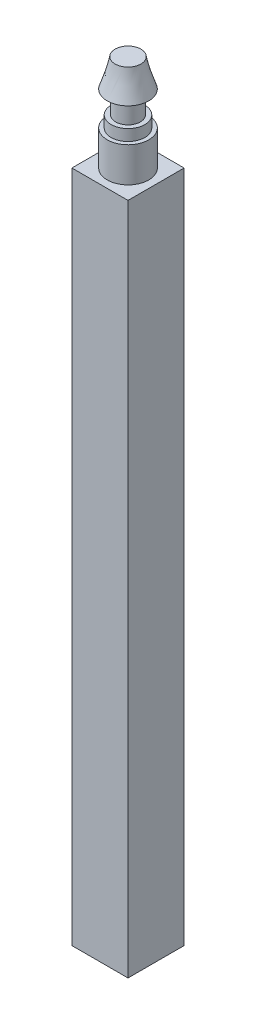
ISO-10303-21;
HEADER;
FILE_DESCRIPTION(('STEP AP214'),'2;1');
FILE_NAME('part.step','',(''),(''),'','','');
FILE_SCHEMA(('AUTOMOTIVE_DESIGN { 1 0 10303 214 1 1 1 1 }'));
ENDSEC;
DATA;
#1=APPLICATION_CONTEXT('core data for automotive mechanical design processes');
#2=APPLICATION_PROTOCOL_DEFINITION('international standard','automotive_design',2000,#1);
#3=PRODUCT_CONTEXT('',#1,'mechanical');
#4=PRODUCT('Part','Part','',(#3));
#5=PRODUCT_RELATED_PRODUCT_CATEGORY('part','',(#4));
#6=PRODUCT_DEFINITION_FORMATION('','',#4);
#7=PRODUCT_DEFINITION_CONTEXT('part definition',#1,'design');
#8=PRODUCT_DEFINITION('design','',#6,#7);
#9=PRODUCT_DEFINITION_SHAPE('','',#8);
#10=(LENGTH_UNIT() NAMED_UNIT(*) SI_UNIT(.MILLI.,.METRE.));
#11=(NAMED_UNIT(*) PLANE_ANGLE_UNIT() SI_UNIT($,.RADIAN.));
#12=(NAMED_UNIT(*) SI_UNIT($,.STERADIAN.) SOLID_ANGLE_UNIT());
#13=UNCERTAINTY_MEASURE_WITH_UNIT(LENGTH_MEASURE(1.E-05),#10,'distance_accuracy_value','');
#14=(GEOMETRIC_REPRESENTATION_CONTEXT(3) GLOBAL_UNCERTAINTY_ASSIGNED_CONTEXT((#13)) GLOBAL_UNIT_ASSIGNED_CONTEXT((#10,
#11,#12)) REPRESENTATION_CONTEXT('',''));
#15=CARTESIAN_POINT('',(0.,0.,0.));
#16=DIRECTION('',(0.,0.,1.));
#17=DIRECTION('',(1.,0.,0.));
#18=AXIS2_PLACEMENT_3D('',#15,#16,#17);
#19=CARTESIAN_POINT('',(0.,3.1,0.));
#20=DIRECTION('',(0.,-1.,0.));
#21=DIRECTION('',(0.,0.,-1.));
#22=AXIS2_PLACEMENT_3D('',#19,#20,#21);
#23=CYLINDRICAL_SURFACE('',#22,1.85);
#24=CARTESIAN_POINT('',(0.,3.1,0.));
#25=DIRECTION('',(0.,1.,0.));
#26=DIRECTION('',(0.,0.,1.));
#27=AXIS2_PLACEMENT_3D('',#24,#25,#26);
#28=CIRCLE('',#27,1.85);
#29=CARTESIAN_POINT('',(0.,3.1,-1.85));
#30=VERTEX_POINT('',#29);
#31=EDGE_CURVE('E175',#30,#30,#28,.T.);
#32=CARTESIAN_POINT('',(0.,0.,0.));
#33=DIRECTION('',(0.,1.,0.));
#34=DIRECTION('',(0.,0.,1.));
#35=AXIS2_PLACEMENT_3D('',#32,#33,#34);
#36=CIRCLE('',#35,1.85);
#37=CARTESIAN_POINT('',(0.,0.,-1.85));
#38=VERTEX_POINT('',#37);
#39=EDGE_CURVE('E42',#38,#38,#36,.T.);
#40=CARTESIAN_POINT('',(0.,3.1,-1.85));
#41=CARTESIAN_POINT('',(0.,3.06770833333333,-1.85));
#42=CARTESIAN_POINT('',(0.,3.03541666666667,-1.85));
#43=CARTESIAN_POINT('',(0.,2.97083333333333,-1.85));
#44=CARTESIAN_POINT('',(0.,2.93854166666667,-1.85));
#45=CARTESIAN_POINT('',(0.,2.87395833333333,-1.85));
#46=CARTESIAN_POINT('',(0.,2.84166666666667,-1.85));
#47=CARTESIAN_POINT('',(0.,2.77708333333333,-1.85));
#48=CARTESIAN_POINT('',(0.,2.74479166666667,-1.85));
#49=CARTESIAN_POINT('',(0.,2.68020833333333,-1.85));
#50=CARTESIAN_POINT('',(0.,2.64791666666667,-1.85));
#51=CARTESIAN_POINT('',(0.,2.58333333333333,-1.85));
#52=CARTESIAN_POINT('',(0.,2.55104166666667,-1.85));
#53=CARTESIAN_POINT('',(0.,2.48645833333333,-1.85));
#54=CARTESIAN_POINT('',(0.,2.45416666666667,-1.85));
#55=CARTESIAN_POINT('',(0.,2.38958333333333,-1.85));
#56=CARTESIAN_POINT('',(0.,2.35729166666667,-1.85));
#57=CARTESIAN_POINT('',(0.,2.29270833333333,-1.85));
#58=CARTESIAN_POINT('',(0.,2.26041666666667,-1.85));
#59=CARTESIAN_POINT('',(0.,2.19583333333333,-1.85));
#60=CARTESIAN_POINT('',(0.,2.16354166666667,-1.85));
#61=CARTESIAN_POINT('',(0.,2.09895833333333,-1.85));
#62=CARTESIAN_POINT('',(0.,2.06666666666667,-1.85));
#63=CARTESIAN_POINT('',(0.,2.00208333333333,-1.85));
#64=CARTESIAN_POINT('',(0.,1.96979166666667,-1.85));
#65=CARTESIAN_POINT('',(0.,1.90520833333333,-1.85));
#66=CARTESIAN_POINT('',(0.,1.87291666666667,-1.85));
#67=CARTESIAN_POINT('',(0.,1.80833333333333,-1.85));
#68=CARTESIAN_POINT('',(0.,1.77604166666667,-1.85));
#69=CARTESIAN_POINT('',(0.,1.71145833333333,-1.85));
#70=CARTESIAN_POINT('',(0.,1.67916666666667,-1.85));
#71=CARTESIAN_POINT('',(0.,1.61458333333333,-1.85));
#72=CARTESIAN_POINT('',(0.,1.58229166666667,-1.85));
#73=CARTESIAN_POINT('',(0.,1.51770833333333,-1.85));
#74=CARTESIAN_POINT('',(0.,1.48541666666667,-1.85));
#75=CARTESIAN_POINT('',(0.,1.42083333333333,-1.85));
#76=CARTESIAN_POINT('',(0.,1.38854166666667,-1.85));
#77=CARTESIAN_POINT('',(0.,1.32395833333333,-1.85));
#78=CARTESIAN_POINT('',(0.,1.29166666666667,-1.85));
#79=CARTESIAN_POINT('',(0.,1.22708333333333,-1.85));
#80=CARTESIAN_POINT('',(0.,1.19479166666667,-1.85));
#81=CARTESIAN_POINT('',(0.,1.13020833333333,-1.85));
#82=CARTESIAN_POINT('',(0.,1.09791666666667,-1.85));
#83=CARTESIAN_POINT('',(0.,1.03333333333333,-1.85));
#84=CARTESIAN_POINT('',(0.,1.00104166666667,-1.85));
#85=CARTESIAN_POINT('',(0.,0.936458333333333,-1.85));
#86=CARTESIAN_POINT('',(0.,0.904166666666667,-1.85));
#87=CARTESIAN_POINT('',(0.,0.839583333333333,-1.85));
#88=CARTESIAN_POINT('',(0.,0.807291666666667,-1.85));
#89=CARTESIAN_POINT('',(0.,0.742708333333333,-1.85));
#90=CARTESIAN_POINT('',(0.,0.710416666666667,-1.85));
#91=CARTESIAN_POINT('',(0.,0.645833333333333,-1.85));
#92=CARTESIAN_POINT('',(0.,0.613541666666667,-1.85));
#93=CARTESIAN_POINT('',(0.,0.548958333333333,-1.85));
#94=CARTESIAN_POINT('',(0.,0.516666666666667,-1.85));
#95=CARTESIAN_POINT('',(0.,0.452083333333333,-1.85));
#96=CARTESIAN_POINT('',(0.,0.419791666666667,-1.85));
#97=CARTESIAN_POINT('',(0.,0.355208333333333,-1.85));
#98=CARTESIAN_POINT('',(0.,0.322916666666667,-1.85));
#99=CARTESIAN_POINT('',(0.,0.258333333333333,-1.85));
#100=CARTESIAN_POINT('',(0.,0.226041666666667,-1.85));
#101=CARTESIAN_POINT('',(0.,0.161458333333333,-1.85));
#102=CARTESIAN_POINT('',(0.,0.129166666666667,-1.85));
#103=CARTESIAN_POINT('',(0.,0.0645833333333335,-1.85));
#104=CARTESIAN_POINT('',(0.,0.0322916666666667,-1.85));
#105=CARTESIAN_POINT('',(0.,0.,-1.85));
#106=B_SPLINE_CURVE_WITH_KNOTS('',3,(#40,#41,#42,#43,#44,#45,#46,#47,#48,#49,#50,#51,#52,#53,
#54,#55,#56,#57,#58,#59,#60,#61,#62,#63,#64,#65,#66,#67,#68,#69,#70,#71,#72,#73,#74,#75,#76,#77,
#78,#79,#80,#81,#82,#83,#84,#85,#86,#87,#88,#89,#90,#91,#92,#93,#94,#95,#96,#97,#98,#99,#100,
#101,#102,#103,#104,#105),.UNSPECIFIED.,.F.,.F.,(4,2,2,2,2,2,2,2,2,2,2,2,2,2,2,2,2,2,2,2,2,2,2,
2,2,2,2,2,2,2,2,2,4),(0.,0.0968749999999997,0.19375,0.290625,0.3875,0.484375,0.58125,0.678125,
0.775,0.871874999999999,0.96875,1.065625,1.1625,1.259375,1.35625,1.453125,1.55,1.646875,1.74375,
1.840625,1.9375,2.034375,2.13125,2.228125,2.325,2.421875,2.51875,2.615625,2.7125,2.809375,
2.90625,3.003125,3.1),.UNSPECIFIED.);
#107=EDGE_CURVE('BSEAM39',#30,#38,#106,.T.);
#108=ORIENTED_EDGE('',*,*,#31,.F.);
#109=ORIENTED_EDGE('',*,*,#39,.T.);
#110=ORIENTED_EDGE('',*,*,#107,.T.);
#111=ORIENTED_EDGE('',*,*,#107,.F.);
#112=EDGE_LOOP('',(#108,#110,#109,#111));
#113=FACE_BOUND('',#112,.T.);
#114=ADVANCED_FACE('F39',(#113),#23,.T.);
#115=CARTESIAN_POINT('',(0.,3.1,0.));
#116=DIRECTION('',(0.,1.,0.));
#117=DIRECTION('',(0.,0.,1.));
#118=AXIS2_PLACEMENT_3D('',#115,#116,#117);
#119=PLANE('',#118);
#120=CARTESIAN_POINT('',(0.,3.1,0.));
#121=DIRECTION('',(0.,1.,0.));
#122=DIRECTION('',(0.,0.,1.));
#123=AXIS2_PLACEMENT_3D('',#120,#121,#122);
#124=CIRCLE('',#123,1.5);
#125=CARTESIAN_POINT('',(0.,3.1,1.5));
#126=VERTEX_POINT('',#125);
#127=EDGE_CURVE('E48',#126,#126,#124,.T.);
#128=ORIENTED_EDGE('',*,*,#127,.F.);
#129=EDGE_LOOP('',(#128));
#130=FACE_BOUND('',#129,.T.);
#131=ORIENTED_EDGE('',*,*,#31,.T.);
#132=EDGE_LOOP('',(#131));
#133=FACE_BOUND('',#132,.T.);
#134=ADVANCED_FACE('F180',(#130,#133),#119,.T.);
#135=CARTESIAN_POINT('',(0.,4.1,0.));
#136=DIRECTION('',(0.,-1.,0.));
#137=DIRECTION('',(0.,0.,-1.));
#138=AXIS2_PLACEMENT_3D('',#135,#136,#137);
#139=CYLINDRICAL_SURFACE('',#138,1.5);
#140=CARTESIAN_POINT('',(0.,4.1,0.));
#141=DIRECTION('',(0.,1.,0.));
#142=DIRECTION('',(0.,0.,1.));
#143=AXIS2_PLACEMENT_3D('',#140,#141,#142);
#144=CIRCLE('',#143,1.5);
#145=CARTESIAN_POINT('',(0.,4.1,1.5));
#146=VERTEX_POINT('',#145);
#147=EDGE_CURVE('E171',#146,#146,#144,.T.);
#148=ORIENTED_EDGE('',*,*,#147,.F.);
#149=EDGE_LOOP('',(#148));
#150=FACE_BOUND('',#149,.T.);
#151=ORIENTED_EDGE('',*,*,#127,.T.);
#152=EDGE_LOOP('',(#151));
#153=FACE_BOUND('',#152,.T.);
#154=ADVANCED_FACE('F203',(#150,#153),#139,.T.);
#155=CARTESIAN_POINT('',(0.,4.1,0.));
#156=DIRECTION('',(0.,1.,0.));
#157=DIRECTION('',(0.,0.,1.));
#158=AXIS2_PLACEMENT_3D('',#155,#156,#157);
#159=PLANE('',#158);
#160=CARTESIAN_POINT('',(0.,4.1,0.));
#161=DIRECTION('',(0.,1.,0.));
#162=DIRECTION('',(0.,0.,1.));
#163=AXIS2_PLACEMENT_3D('',#160,#161,#162);
#164=CIRCLE('',#163,1.1);
#165=CARTESIAN_POINT('',(0.,4.1,1.1));
#166=VERTEX_POINT('',#165);
#167=EDGE_CURVE('E12',#166,#166,#164,.T.);
#168=ORIENTED_EDGE('',*,*,#167,.F.);
#169=EDGE_LOOP('',(#168));
#170=FACE_BOUND('',#169,.T.);
#171=ORIENTED_EDGE('',*,*,#147,.T.);
#172=EDGE_LOOP('',(#171));
#173=FACE_BOUND('',#172,.T.);
#174=ADVANCED_FACE('F198',(#170,#173),#159,.T.);
#175=CARTESIAN_POINT('',(0.,6.1,0.));
#176=DIRECTION('',(0.,-1.,0.));
#177=DIRECTION('',(0.,0.,-1.));
#178=AXIS2_PLACEMENT_3D('',#175,#176,#177);
#179=CYLINDRICAL_SURFACE('',#178,1.1);
#180=CARTESIAN_POINT('',(0.,6.1,0.));
#181=DIRECTION('',(0.,1.,0.));
#182=DIRECTION('',(0.,0.,1.));
#183=AXIS2_PLACEMENT_3D('',#180,#181,#182);
#184=CIRCLE('',#183,1.1);
#185=CARTESIAN_POINT('',(0.,6.1,1.1));
#186=VERTEX_POINT('',#185);
#187=EDGE_CURVE('E167',#186,#186,#184,.T.);
#188=ORIENTED_EDGE('',*,*,#187,.F.);
#189=EDGE_LOOP('',(#188));
#190=FACE_BOUND('',#189,.T.);
#191=ORIENTED_EDGE('',*,*,#167,.T.);
#192=EDGE_LOOP('',(#191));
#193=FACE_BOUND('',#192,.T.);
#194=ADVANCED_FACE('F154',(#190,#193),#179,.T.);
#195=CARTESIAN_POINT('',(0.,8.6,0.));
#196=DIRECTION('',(0.,1.,0.));
#197=DIRECTION('',(0.,0.,1.));
#198=AXIS2_PLACEMENT_3D('',#195,#196,#197);
#199=PLANE('',#198);
#200=CARTESIAN_POINT('',(0.,8.6,0.));
#201=DIRECTION('',(0.,1.,0.));
#202=DIRECTION('',(0.,0.,1.));
#203=AXIS2_PLACEMENT_3D('',#200,#201,#202);
#204=CIRCLE('',#203,1.15);
#205=CARTESIAN_POINT('',(0.620465420838555,8.6,0.968257538851949));
#206=VERTEX_POINT('',#205);
#207=EDGE_CURVE('E122',#206,#206,#204,.T.);
#208=ORIENTED_EDGE('',*,*,#207,.T.);
#209=EDGE_LOOP('',(#208));
#210=FACE_BOUND('',#209,.T.);
#211=ADVANCED_FACE('F145',(#210),#199,.T.);
#212=CARTESIAN_POINT('',(0.,6.1,0.));
#213=DIRECTION('',(0.,1.,0.));
#214=DIRECTION('',(0.,0.,1.));
#215=AXIS2_PLACEMENT_3D('',#212,#213,#214);
#216=PLANE('',#215);
#217=ORIENTED_EDGE('',*,*,#187,.T.);
#218=EDGE_LOOP('',(#217));
#219=FACE_BOUND('',#218,.T.);
#220=CARTESIAN_POINT('',(0.,6.1,0.));
#221=DIRECTION('',(0.,1.,0.));
#222=DIRECTION('',(0.,0.,1.));
#223=AXIS2_PLACEMENT_3D('',#220,#221,#222);
#224=CIRCLE('',#223,1.85);
#225=CARTESIAN_POINT('',(0.,6.1,1.85));
#226=VERTEX_POINT('',#225);
#227=EDGE_CURVE('E127',#226,#226,#224,.T.);
#228=ORIENTED_EDGE('',*,*,#227,.F.);
#229=EDGE_LOOP('',(#228));
#230=FACE_BOUND('',#229,.T.);
#231=ADVANCED_FACE('F142',(#219,#230),#216,.F.);
#232=CARTESIAN_POINT('',(0.,6.1,1.85));
#233=CARTESIAN_POINT('',(0.620465420838555,8.6,0.968257538851949));
#234=CARTESIAN_POINT('',(3.7,6.1,1.85));
#235=CARTESIAN_POINT('',(2.55698049854245,8.6,-0.272673302825161));
#236=CARTESIAN_POINT('',(3.7,6.1,-1.85));
#237=CARTESIAN_POINT('',(1.31604965686534,8.6,-2.20918838052906));
#238=CARTESIAN_POINT('',(0.,6.1,-1.85));
#239=CARTESIAN_POINT('',(-0.620465420838555,8.6,-0.96825753885195));
#240=CARTESIAN_POINT('',(-3.7,6.1,-1.85));
#241=CARTESIAN_POINT('',(-2.55698049854246,8.6,0.272673302825162));
#242=CARTESIAN_POINT('',(-3.7,6.1,1.85));
#243=CARTESIAN_POINT('',(-1.31604965686534,8.6,2.20918838052906));
#244=CARTESIAN_POINT('',(0.,6.1,1.85));
#245=CARTESIAN_POINT('',(0.620465420838555,8.6,0.968257538851949));
#246=(BOUNDED_SURFACE() B_SPLINE_SURFACE(3,1,((#232,#233),(#234,#235),(#236,#237),(#238,#239),
(#240,#241),(#242,#243),(#244,#245)),.UNSPECIFIED.,.T.,.F.,.F.) B_SPLINE_SURFACE_WITH_KNOTS((4,
3,4),(2,2),(0.,0.5,1.),(0.,1.),
.UNSPECIFIED.) GEOMETRIC_REPRESENTATION_ITEM() RATIONAL_B_SPLINE_SURFACE(((1.,1.),
(0.333333333333333,0.333333333333333),(0.333333333333333,0.333333333333333),(1.,1.),
(0.333333333333333,0.333333333333333),(0.333333333333333,0.333333333333333),(1.,1.))) REPRESENTATION_ITEM('') SURFACE());
#247=CARTESIAN_POINT('',(0.,6.1,1.85));
#248=CARTESIAN_POINT('',(0.00646318146706835,6.12604166666667,1.84081518269637));
#249=CARTESIAN_POINT('',(0.0129263629341366,6.15208333333333,1.83163036539275));
#250=CARTESIAN_POINT('',(0.0258527258682731,6.20416666666667,1.8132607307855));
#251=CARTESIAN_POINT('',(0.0323159073353414,6.23020833333333,1.80407591348187));
#252=CARTESIAN_POINT('',(0.045242270269478,6.28229166666667,1.78570627887462));
#253=CARTESIAN_POINT('',(0.0517054517365463,6.30833333333333,1.776521461571));
#254=CARTESIAN_POINT('',(0.0646318146706829,6.36041666666667,1.75815182696374));
#255=CARTESIAN_POINT('',(0.0710949961377511,6.38645833333333,1.74896700966012));
#256=CARTESIAN_POINT('',(0.0840213590718877,6.43854166666667,1.73059737505287));
#257=CARTESIAN_POINT('',(0.090484540538956,6.46458333333333,1.72141255774924));
#258=CARTESIAN_POINT('',(0.103410903473093,6.51666666666667,1.70304292314199));
#259=CARTESIAN_POINT('',(0.109874084940161,6.54270833333333,1.69385810583837));
#260=CARTESIAN_POINT('',(0.122800447874297,6.59479166666667,1.67548847123112));
#261=CARTESIAN_POINT('',(0.129263629341366,6.62083333333333,1.66630365392749));
#262=CARTESIAN_POINT('',(0.142189992275502,6.67291666666667,1.64793401932024));
#263=CARTESIAN_POINT('',(0.148653173742571,6.69895833333333,1.63874920201661));
#264=CARTESIAN_POINT('',(0.161579536676707,6.75104166666667,1.62037956740936));
#265=CARTESIAN_POINT('',(0.168042718143775,6.77708333333333,1.61119475010574));
#266=CARTESIAN_POINT('',(0.180969081077912,6.82916666666667,1.59282511549849));
#267=CARTESIAN_POINT('',(0.18743226254498,6.85520833333333,1.58364029819486));
#268=CARTESIAN_POINT('',(0.200358625479117,6.90729166666667,1.56527066358761));
#269=CARTESIAN_POINT('',(0.206821806946185,6.93333333333333,1.55608584628398));
#270=CARTESIAN_POINT('',(0.219748169880322,6.98541666666667,1.53771621167673));
#271=CARTESIAN_POINT('',(0.22621135134739,7.01145833333333,1.52853139437311));
#272=CARTESIAN_POINT('',(0.239137714281527,7.06354166666667,1.51016175976586));
#273=CARTESIAN_POINT('',(0.245600895748595,7.08958333333333,1.50097694246223));
#274=CARTESIAN_POINT('',(0.258527258682731,7.14166666666667,1.48260730785498));
#275=CARTESIAN_POINT('',(0.2649904401498,7.16770833333333,1.47342249055135));
#276=CARTESIAN_POINT('',(0.277916803083936,7.21979166666667,1.4550528559441));
#277=CARTESIAN_POINT('',(0.284379984551005,7.24583333333333,1.44586803864048));
#278=CARTESIAN_POINT('',(0.297306347485141,7.29791666666667,1.42749840403323));
#279=CARTESIAN_POINT('',(0.303769528952209,7.32395833333333,1.4183135867296));
#280=CARTESIAN_POINT('',(0.316695891886346,7.37604166666667,1.39994395212235));
#281=CARTESIAN_POINT('',(0.323159073353414,7.40208333333333,1.39075913481872));
#282=CARTESIAN_POINT('',(0.336085436287551,7.45416666666667,1.37238950021147));
#283=CARTESIAN_POINT('',(0.342548617754619,7.48020833333333,1.36320468290785));
#284=CARTESIAN_POINT('',(0.355474980688756,7.53229166666667,1.3448350483006));
#285=CARTESIAN_POINT('',(0.361938162155824,7.55833333333333,1.33565023099697));
#286=CARTESIAN_POINT('',(0.374864525089961,7.61041666666667,1.31728059638972));
#287=CARTESIAN_POINT('',(0.381327706557029,7.63645833333333,1.30809577908609));
#288=CARTESIAN_POINT('',(0.394254069491165,7.68854166666667,1.28972614447884));
#289=CARTESIAN_POINT('',(0.400717250958234,7.71458333333333,1.28054132717522));
#290=CARTESIAN_POINT('',(0.41364361389237,7.76666666666667,1.26217169256797));
#291=CARTESIAN_POINT('',(0.420106795359439,7.79270833333333,1.25298687526434));
#292=CARTESIAN_POINT('',(0.433033158293575,7.84479166666667,1.23461724065709));
#293=CARTESIAN_POINT('',(0.439496339760643,7.87083333333333,1.22543242335346));
#294=CARTESIAN_POINT('',(0.45242270269478,7.92291666666667,1.20706278874621));
#295=CARTESIAN_POINT('',(0.458885884161848,7.94895833333333,1.19787797144259));
#296=CARTESIAN_POINT('',(0.471812247095985,8.00104166666667,1.17950833683534));
#297=CARTESIAN_POINT('',(0.478275428563053,8.02708333333333,1.17032351953171));
#298=CARTESIAN_POINT('',(0.49120179149719,8.07916666666667,1.15195388492446));
#299=CARTESIAN_POINT('',(0.497664972964258,8.10520833333333,1.14276906762083));
#300=CARTESIAN_POINT('',(0.510591335898395,8.15729166666667,1.12439943301358));
#301=CARTESIAN_POINT('',(0.517054517365463,8.18333333333333,1.11521461570996));
#302=CARTESIAN_POINT('',(0.529980880299599,8.23541666666667,1.09684498110271));
#303=CARTESIAN_POINT('',(0.536444061766668,8.26145833333333,1.08766016379908));
#304=CARTESIAN_POINT('',(0.549370424700804,8.31354166666667,1.06929052919183));
#305=CARTESIAN_POINT('',(0.555833606167872,8.33958333333333,1.0601057118882));
#306=CARTESIAN_POINT('',(0.568759969102009,8.39166666666667,1.04173607728095));
#307=CARTESIAN_POINT('',(0.575223150569077,8.41770833333333,1.03255125997733));
#308=CARTESIAN_POINT('',(0.588149513503214,8.46979166666667,1.01418162537008));
#309=CARTESIAN_POINT('',(0.594612694970282,8.49583333333333,1.00499680806645));
#310=CARTESIAN_POINT('',(0.607539057904419,8.54791666666667,0.9866271734592));
#311=CARTESIAN_POINT('',(0.614002239371487,8.57395833333333,0.977442356155575));
#312=CARTESIAN_POINT('',(0.620465420838555,8.6,0.968257538851949));
#313=B_SPLINE_CURVE_WITH_KNOTS('',3,(#247,#248,#249,#250,#251,#252,#253,#254,#255,#256,#257,
#258,#259,#260,#261,#262,#263,#264,#265,#266,#267,#268,#269,#270,#271,#272,#273,#274,#275,#276,
#277,#278,#279,#280,#281,#282,#283,#284,#285,#286,#287,#288,#289,#290,#291,#292,#293,#294,#295,
#296,#297,#298,#299,#300,#301,#302,#303,#304,#305,#306,#307,#308,#309,#310,#311,#312),
.UNSPECIFIED.,.F.,.F.,(4,2,2,2,2,2,2,2,2,2,2,2,2,2,2,2,2,2,2,2,2,2,2,2,2,2,2,2,2,2,2,2,4),(0.,
0.0850806551290898,0.17016131025818,0.255241965387269,0.340322620516359,0.425403275645449,
0.510483930774539,0.595564585903629,0.680645241032718,0.765725896161807,0.850806551290897,
0.935887206419988,1.02096786154908,1.10604851667817,1.19112917180726,1.27620982693635,
1.36129048206544,1.44637113719453,1.53145179232361,1.6165324474527,1.70161310258179,
1.78669375771088,1.87177441283997,1.95685506796906,2.04193572309815,2.12701637822724,
2.21209703335633,2.29717768848542,2.38225834361451,2.4673389987436,2.55241965387269,
2.63750030900178,2.72258096413087),.UNSPECIFIED.);
#314=EDGE_CURVE('BSEAM129',#226,#206,#313,.T.);
#315=ORIENTED_EDGE('',*,*,#227,.T.);
#316=ORIENTED_EDGE('',*,*,#207,.F.);
#317=ORIENTED_EDGE('',*,*,#314,.T.);
#318=ORIENTED_EDGE('',*,*,#314,.F.);
#319=EDGE_LOOP('',(#315,#317,#316,#318));
#320=FACE_BOUND('',#319,.T.);
#321=ADVANCED_FACE('F129',(#320),#246,.T.);
#322=CARTESIAN_POINT('',(2.5,-60.,2.5));
#323=DIRECTION('',(-1.,0.,0.));
#324=DIRECTION('',(0.,0.,1.));
#325=AXIS2_PLACEMENT_3D('',#322,#323,#324);
#326=PLANE('',#325);
#327=DIRECTION('',(0.,0.,1.));
#328=VECTOR('',#327,1.);
#329=CARTESIAN_POINT('',(2.5,0.,2.5));
#330=LINE('',#329,#328);
#331=CARTESIAN_POINT('',(2.5,0.,-2.5));
#332=VERTEX_POINT('',#331);
#333=CARTESIAN_POINT('',(2.5,0.,2.5));
#334=VERTEX_POINT('',#333);
#335=EDGE_CURVE('E108',#332,#334,#330,.T.);
#336=ORIENTED_EDGE('',*,*,#335,.T.);
#337=DIRECTION('',(0.,1.,0.));
#338=VECTOR('',#337,1.);
#339=CARTESIAN_POINT('',(2.5,-60.,2.5));
#340=LINE('',#339,#338);
#341=CARTESIAN_POINT('',(2.5,-60.,2.5));
#342=VERTEX_POINT('',#341);
#343=EDGE_CURVE('E99',#342,#334,#340,.T.);
#344=ORIENTED_EDGE('',*,*,#343,.F.);
#345=DIRECTION('',(0.,0.,1.));
#346=VECTOR('',#345,1.);
#347=CARTESIAN_POINT('',(2.5,-60.,2.5));
#348=LINE('',#347,#346);
#349=CARTESIAN_POINT('',(2.5,-60.,-2.5));
#350=VERTEX_POINT('',#349);
#351=EDGE_CURVE('E93',#350,#342,#348,.T.);
#352=ORIENTED_EDGE('',*,*,#351,.F.);
#353=DIRECTION('',(0.,1.,0.));
#354=VECTOR('',#353,1.);
#355=CARTESIAN_POINT('',(2.5,-60.,-2.5));
#356=LINE('',#355,#354);
#357=EDGE_CURVE('E104',#350,#332,#356,.T.);
#358=ORIENTED_EDGE('',*,*,#357,.T.);
#359=EDGE_LOOP('',(#336,#344,#352,#358));
#360=FACE_BOUND('',#359,.T.);
#361=ADVANCED_FACE('F141',(#360),#326,.F.);
#362=CARTESIAN_POINT('',(-2.5,-60.,2.5));
#363=DIRECTION('',(0.,0.,-1.));
#364=DIRECTION('',(-1.,0.,0.));
#365=AXIS2_PLACEMENT_3D('',#362,#363,#364);
#366=PLANE('',#365);
#367=DIRECTION('',(-1.,0.,0.));
#368=VECTOR('',#367,1.);
#369=CARTESIAN_POINT('',(-2.5,0.,2.5));
#370=LINE('',#369,#368);
#371=CARTESIAN_POINT('',(-2.5,0.,2.5));
#372=VERTEX_POINT('',#371);
#373=EDGE_CURVE('E98',#334,#372,#370,.T.);
#374=ORIENTED_EDGE('',*,*,#373,.T.);
#375=DIRECTION('',(0.,1.,0.));
#376=VECTOR('',#375,1.);
#377=CARTESIAN_POINT('',(-2.5,-60.,2.5));
#378=LINE('',#377,#376);
#379=CARTESIAN_POINT('',(-2.5,-60.,2.5));
#380=VERTEX_POINT('',#379);
#381=EDGE_CURVE('E96',#380,#372,#378,.T.);
#382=ORIENTED_EDGE('',*,*,#381,.F.);
#383=DIRECTION('',(-1.,0.,0.));
#384=VECTOR('',#383,1.);
#385=CARTESIAN_POINT('',(-2.5,-60.,2.5));
#386=LINE('',#385,#384);
#387=EDGE_CURVE('E88',#342,#380,#386,.T.);
#388=ORIENTED_EDGE('',*,*,#387,.F.);
#389=ORIENTED_EDGE('',*,*,#343,.T.);
#390=EDGE_LOOP('',(#374,#382,#388,#389));
#391=FACE_BOUND('',#390,.T.);
#392=ADVANCED_FACE('F97',(#391),#366,.F.);
#393=CARTESIAN_POINT('',(-2.5,-60.,2.5));
#394=DIRECTION('',(1.,0.,0.));
#395=DIRECTION('',(0.,0.,-1.));
#396=AXIS2_PLACEMENT_3D('',#393,#394,#395);
#397=PLANE('',#396);
#398=DIRECTION('',(0.,0.,-1.));
#399=VECTOR('',#398,1.);
#400=CARTESIAN_POINT('',(-2.5,0.,2.5));
#401=LINE('',#400,#399);
#402=CARTESIAN_POINT('',(-2.5,0.,-2.5));
#403=VERTEX_POINT('',#402);
#404=EDGE_CURVE('E74',#372,#403,#401,.T.);
#405=ORIENTED_EDGE('',*,*,#404,.T.);
#406=DIRECTION('',(0.,1.,0.));
#407=VECTOR('',#406,1.);
#408=CARTESIAN_POINT('',(-2.5,-60.,-2.5));
#409=LINE('',#408,#407);
#410=CARTESIAN_POINT('',(-2.5,-60.,-2.5));
#411=VERTEX_POINT('',#410);
#412=EDGE_CURVE('E100',#411,#403,#409,.T.);
#413=ORIENTED_EDGE('',*,*,#412,.F.);
#414=DIRECTION('',(0.,0.,-1.));
#415=VECTOR('',#414,1.);
#416=CARTESIAN_POINT('',(-2.5,-60.,2.5));
#417=LINE('',#416,#415);
#418=EDGE_CURVE('E91',#380,#411,#417,.T.);
#419=ORIENTED_EDGE('',*,*,#418,.F.);
#420=ORIENTED_EDGE('',*,*,#381,.T.);
#421=EDGE_LOOP('',(#405,#413,#419,#420));
#422=FACE_BOUND('',#421,.T.);
#423=ADVANCED_FACE('F102',(#422),#397,.F.);
#424=CARTESIAN_POINT('',(-2.5,-60.,-2.5));
#425=DIRECTION('',(0.,0.,1.));
#426=DIRECTION('',(1.,0.,0.));
#427=AXIS2_PLACEMENT_3D('',#424,#425,#426);
#428=PLANE('',#427);
#429=DIRECTION('',(1.,0.,0.));
#430=VECTOR('',#429,1.);
#431=CARTESIAN_POINT('',(-2.5,0.,-2.5));
#432=LINE('',#431,#430);
#433=EDGE_CURVE('E80',#403,#332,#432,.T.);
#434=ORIENTED_EDGE('',*,*,#433,.T.);
#435=ORIENTED_EDGE('',*,*,#357,.F.);
#436=DIRECTION('',(1.,0.,0.));
#437=VECTOR('',#436,1.);
#438=CARTESIAN_POINT('',(-2.5,-60.,-2.5));
#439=LINE('',#438,#437);
#440=EDGE_CURVE('E57',#411,#350,#439,.T.);
#441=ORIENTED_EDGE('',*,*,#440,.F.);
#442=ORIENTED_EDGE('',*,*,#412,.T.);
#443=EDGE_LOOP('',(#434,#435,#441,#442));
#444=FACE_BOUND('',#443,.T.);
#445=ADVANCED_FACE('F267',(#444),#428,.F.);
#446=CARTESIAN_POINT('',(0.,-60.,0.));
#447=DIRECTION('',(0.,-1.,0.));
#448=DIRECTION('',(0.,0.,-1.));
#449=AXIS2_PLACEMENT_3D('',#446,#447,#448);
#450=PLANE('',#449);
#451=CARTESIAN_POINT('',(0.,-60.,0.));
#452=DIRECTION('',(0.,-1.,0.));
#453=DIRECTION('',(0.,0.,-1.));
#454=AXIS2_PLACEMENT_3D('',#451,#452,#453);
#455=CIRCLE('',#454,1.);
#456=CARTESIAN_POINT('',(0.,-60.,-1.));
#457=VERTEX_POINT('',#456);
#458=EDGE_CURVE('E319',#457,#457,#455,.T.);
#459=ORIENTED_EDGE('',*,*,#458,.F.);
#460=EDGE_LOOP('',(#459));
#461=FACE_BOUND('',#460,.T.);
#462=ORIENTED_EDGE('',*,*,#351,.T.);
#463=ORIENTED_EDGE('',*,*,#387,.T.);
#464=ORIENTED_EDGE('',*,*,#418,.T.);
#465=ORIENTED_EDGE('',*,*,#440,.T.);
#466=EDGE_LOOP('',(#462,#463,#464,#465));
#467=FACE_BOUND('',#466,.T.);
#468=ADVANCED_FACE('F89',(#461,#467),#450,.T.);
#469=CARTESIAN_POINT('',(0.,0.,0.));
#470=DIRECTION('',(0.,-1.,0.));
#471=DIRECTION('',(0.,0.,-1.));
#472=AXIS2_PLACEMENT_3D('',#469,#470,#471);
#473=PLANE('',#472);
#474=ORIENTED_EDGE('',*,*,#39,.F.);
#475=EDGE_LOOP('',(#474));
#476=FACE_BOUND('',#475,.T.);
#477=ORIENTED_EDGE('',*,*,#335,.F.);
#478=ORIENTED_EDGE('',*,*,#433,.F.);
#479=ORIENTED_EDGE('',*,*,#404,.F.);
#480=ORIENTED_EDGE('',*,*,#373,.F.);
#481=EDGE_LOOP('',(#477,#478,#479,#480));
#482=FACE_BOUND('',#481,.T.);
#483=ADVANCED_FACE('F282',(#476,#482),#473,.F.);
#484=CARTESIAN_POINT('',(0.,-36.,0.));
#485=DIRECTION('',(0.,-1.,0.));
#486=DIRECTION('',(0.,0.,-1.));
#487=AXIS2_PLACEMENT_3D('',#484,#485,#486);
#488=CYLINDRICAL_SURFACE('',#487,1.);
#489=CARTESIAN_POINT('',(0.,-36.,0.));
#490=DIRECTION('',(0.,-1.,0.));
#491=DIRECTION('',(0.,0.,-1.));
#492=AXIS2_PLACEMENT_3D('',#489,#490,#491);
#493=CIRCLE('',#492,1.);
#494=CARTESIAN_POINT('',(0.,-36.,-1.));
#495=VERTEX_POINT('',#494);
#496=EDGE_CURVE('E111',#495,#495,#493,.T.);
#497=ORIENTED_EDGE('',*,*,#496,.F.);
#498=EDGE_LOOP('',(#497));
#499=FACE_BOUND('',#498,.T.);
#500=ORIENTED_EDGE('',*,*,#458,.T.);
#501=EDGE_LOOP('',(#500));
#502=FACE_BOUND('',#501,.T.);
#503=ADVANCED_FACE('F287',(#499,#502),#488,.F.);
#504=CARTESIAN_POINT('',(0.,-36.,0.));
#505=DIRECTION('',(0.,-1.,0.));
#506=DIRECTION('',(0.,0.,-1.));
#507=AXIS2_PLACEMENT_3D('',#504,#505,#506);
#508=PLANE('',#507);
#509=ORIENTED_EDGE('',*,*,#496,.T.);
#510=EDGE_LOOP('',(#509));
#511=FACE_BOUND('',#510,.T.);
#512=ADVANCED_FACE('F303',(#511),#508,.T.);
#513=CLOSED_SHELL('',(#114,#134,#154,#174,#194,#211,#231,#321,#361,#392,#423,#445,#468,#483,
#503,#512));
#514=MANIFOLD_SOLID_BREP('B2',#513);
#515=ADVANCED_BREP_SHAPE_REPRESENTATION('',(#18,#514),#14);
#516=SHAPE_DEFINITION_REPRESENTATION(#9,#515);
ENDSEC;
END-ISO-10303-21;
